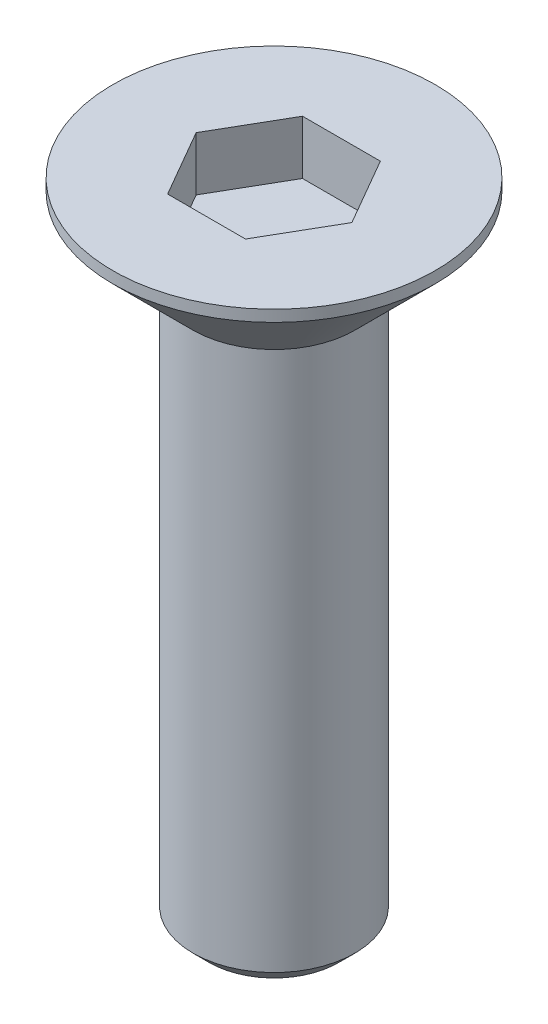
ISO-10303-21;
HEADER;
FILE_DESCRIPTION(('STEP AP214'),'2;1');
FILE_NAME('part.step','',(''),(''),'','','');
FILE_SCHEMA(('AUTOMOTIVE_DESIGN { 1 0 10303 214 1 1 1 1 }'));
ENDSEC;
DATA;
#1=APPLICATION_CONTEXT('core data for automotive mechanical design processes');
#2=APPLICATION_PROTOCOL_DEFINITION('international standard','automotive_design',2000,#1);
#3=PRODUCT_CONTEXT('',#1,'mechanical');
#4=PRODUCT('Part','Part','',(#3));
#5=PRODUCT_RELATED_PRODUCT_CATEGORY('part','',(#4));
#6=PRODUCT_DEFINITION_FORMATION('','',#4);
#7=PRODUCT_DEFINITION_CONTEXT('part definition',#1,'design');
#8=PRODUCT_DEFINITION('design','',#6,#7);
#9=PRODUCT_DEFINITION_SHAPE('','',#8);
#10=(LENGTH_UNIT() NAMED_UNIT(*) SI_UNIT(.MILLI.,.METRE.));
#11=(NAMED_UNIT(*) PLANE_ANGLE_UNIT() SI_UNIT($,.RADIAN.));
#12=(NAMED_UNIT(*) SI_UNIT($,.STERADIAN.) SOLID_ANGLE_UNIT());
#13=UNCERTAINTY_MEASURE_WITH_UNIT(LENGTH_MEASURE(1.E-05),#10,'distance_accuracy_value','');
#14=(GEOMETRIC_REPRESENTATION_CONTEXT(3) GLOBAL_UNCERTAINTY_ASSIGNED_CONTEXT((#13)) GLOBAL_UNIT_ASSIGNED_CONTEXT((#10,
#11,#12)) REPRESENTATION_CONTEXT('',''));
#15=CARTESIAN_POINT('',(0.,0.,0.));
#16=DIRECTION('',(0.,0.,1.));
#17=DIRECTION('',(1.,0.,0.));
#18=AXIS2_PLACEMENT_3D('',#15,#16,#17);
#19=CARTESIAN_POINT('',(0.,0.,0.));
#20=DIRECTION('',(0.,-1.,0.));
#21=DIRECTION('',(0.,0.,-1.));
#22=AXIS2_PLACEMENT_3D('',#19,#20,#21);
#23=PLANE('',#22);
#24=DIRECTION('',(-0.5,0.,0.866025403784439));
#25=VECTOR('',#24,1.);
#26=CARTESIAN_POINT('',(-0.721687836487032,0.,-1.25));
#27=LINE('',#26,#25);
#28=CARTESIAN_POINT('',(-0.721687836487032,0.,-1.25));
#29=VERTEX_POINT('',#28);
#30=CARTESIAN_POINT('',(-1.44337567297406,0.,0.));
#31=VERTEX_POINT('',#30);
#32=EDGE_CURVE('E123',#29,#31,#27,.T.);
#33=ORIENTED_EDGE('',*,*,#32,.F.);
#34=DIRECTION('',(-1.,0.,0.));
#35=VECTOR('',#34,1.);
#36=CARTESIAN_POINT('',(0.721687836487033,0.,-1.25));
#37=LINE('',#36,#35);
#38=CARTESIAN_POINT('',(0.721687836487033,0.,-1.25));
#39=VERTEX_POINT('',#38);
#40=EDGE_CURVE('E49',#39,#29,#37,.T.);
#41=ORIENTED_EDGE('',*,*,#40,.F.);
#42=DIRECTION('',(-0.5,0.,-0.866025403784439));
#43=VECTOR('',#42,1.);
#44=CARTESIAN_POINT('',(1.44337567297406,0.,0.));
#45=LINE('',#44,#43);
#46=CARTESIAN_POINT('',(1.44337567297406,0.,0.));
#47=VERTEX_POINT('',#46);
#48=EDGE_CURVE('E132',#47,#39,#45,.T.);
#49=ORIENTED_EDGE('',*,*,#48,.F.);
#50=DIRECTION('',(0.5,0.,-0.866025403784438));
#51=VECTOR('',#50,1.);
#52=CARTESIAN_POINT('',(0.721687836487032,0.,1.25));
#53=LINE('',#52,#51);
#54=CARTESIAN_POINT('',(0.721687836487032,0.,1.25));
#55=VERTEX_POINT('',#54);
#56=EDGE_CURVE('E130',#55,#47,#53,.T.);
#57=ORIENTED_EDGE('',*,*,#56,.F.);
#58=DIRECTION('',(1.,0.,0.));
#59=VECTOR('',#58,1.);
#60=CARTESIAN_POINT('',(-0.721687836487033,0.,1.25));
#61=LINE('',#60,#59);
#62=CARTESIAN_POINT('',(-0.721687836487033,0.,1.25));
#63=VERTEX_POINT('',#62);
#64=EDGE_CURVE('E97',#63,#55,#61,.T.);
#65=ORIENTED_EDGE('',*,*,#64,.F.);
#66=DIRECTION('',(0.5,0.,0.866025403784439));
#67=VECTOR('',#66,1.);
#68=CARTESIAN_POINT('',(-1.44337567297406,0.,0.));
#69=LINE('',#68,#67);
#70=EDGE_CURVE('E126',#31,#63,#69,.T.);
#71=ORIENTED_EDGE('',*,*,#70,.F.);
#72=EDGE_LOOP('',(#33,#41,#49,#57,#65,#71));
#73=FACE_BOUND('',#72,.T.);
#74=CARTESIAN_POINT('',(0.,0.,0.));
#75=DIRECTION('',(0.,-1.,0.));
#76=DIRECTION('',(0.,0.,-1.));
#77=AXIS2_PLACEMENT_3D('',#74,#75,#76);
#78=CIRCLE('',#77,2.98786796564402);
#79=CARTESIAN_POINT('',(0.,0.,-2.98786796564402));
#80=VERTEX_POINT('',#79);
#81=EDGE_CURVE('E144',#80,#80,#78,.F.);
#82=ORIENTED_EDGE('',*,*,#81,.T.);
#83=EDGE_LOOP('',(#82));
#84=FACE_BOUND('',#83,.T.);
#85=ADVANCED_FACE('F34',(#73,#84),#23,.F.);
#86=CARTESIAN_POINT('',(0.,-1.7,0.));
#87=DIRECTION('',(0.,1.,0.));
#88=DIRECTION('',(0.,0.,1.));
#89=AXIS2_PLACEMENT_3D('',#86,#87,#88);
#90=CONICAL_SURFACE('',#89,1.5,0.785398163397443);
#91=CARTESIAN_POINT('',(0.,-0.212132034355965,0.));
#92=DIRECTION('',(0.,-1.,0.));
#93=DIRECTION('',(0.,0.,-1.));
#94=AXIS2_PLACEMENT_3D('',#91,#92,#93);
#95=CIRCLE('',#94,2.98786796564402);
#96=CARTESIAN_POINT('',(0.,-0.212132034355965,-2.98786796564402));
#97=VERTEX_POINT('',#96);
#98=EDGE_CURVE('E147',#97,#97,#95,.T.);
#99=ORIENTED_EDGE('',*,*,#98,.T.);
#100=EDGE_LOOP('',(#99));
#101=FACE_BOUND('',#100,.T.);
#102=CARTESIAN_POINT('',(0.,-1.7,0.));
#103=DIRECTION('',(0.,1.,0.));
#104=DIRECTION('',(0.,0.,1.));
#105=AXIS2_PLACEMENT_3D('',#102,#103,#104);
#106=CIRCLE('',#105,1.5);
#107=CARTESIAN_POINT('',(0.,-1.7,1.5));
#108=VERTEX_POINT('',#107);
#109=EDGE_CURVE('E136',#108,#108,#106,.T.);
#110=ORIENTED_EDGE('',*,*,#109,.T.);
#111=EDGE_LOOP('',(#110));
#112=FACE_BOUND('',#111,.T.);
#113=ADVANCED_FACE('F169',(#101,#112),#90,.T.);
#114=CARTESIAN_POINT('',(0.,0.,0.));
#115=DIRECTION('',(0.,1.,0.));
#116=DIRECTION('',(0.,0.,1.));
#117=AXIS2_PLACEMENT_3D('',#114,#115,#116);
#118=CYLINDRICAL_SURFACE('',#117,1.5);
#119=CARTESIAN_POINT('',(0.,-11.7,0.));
#120=DIRECTION('',(0.,1.,0.));
#121=DIRECTION('',(0.,0.,1.));
#122=AXIS2_PLACEMENT_3D('',#119,#120,#121);
#123=CIRCLE('',#122,1.5);
#124=CARTESIAN_POINT('',(0.,-11.7,1.5));
#125=VERTEX_POINT('',#124);
#126=EDGE_CURVE('E42',#125,#125,#123,.T.);
#127=ORIENTED_EDGE('',*,*,#126,.T.);
#128=EDGE_LOOP('',(#127));
#129=FACE_BOUND('',#128,.T.);
#130=ORIENTED_EDGE('',*,*,#109,.F.);
#131=EDGE_LOOP('',(#130));
#132=FACE_BOUND('',#131,.T.);
#133=ADVANCED_FACE('F152',(#129,#132),#118,.T.);
#134=CARTESIAN_POINT('',(1.5,-12.,0.));
#135=DIRECTION('',(0.,1.,0.));
#136=DIRECTION('',(0.,0.,1.));
#137=AXIS2_PLACEMENT_3D('',#134,#135,#136);
#138=PLANE('',#137);
#139=CARTESIAN_POINT('',(0.,-12.,0.));
#140=DIRECTION('',(0.,1.,0.));
#141=DIRECTION('',(0.,0.,1.));
#142=AXIS2_PLACEMENT_3D('',#139,#140,#141);
#143=CIRCLE('',#142,1.2);
#144=CARTESIAN_POINT('',(0.,-12.,1.2));
#145=VERTEX_POINT('',#144);
#146=EDGE_CURVE('E11',#145,#145,#143,.F.);
#147=ORIENTED_EDGE('',*,*,#146,.T.);
#148=EDGE_LOOP('',(#147));
#149=FACE_BOUND('',#148,.T.);
#150=ADVANCED_FACE('F165',(#149),#138,.F.);
#151=CARTESIAN_POINT('',(0.,0.,0.));
#152=DIRECTION('',(0.,-1.,0.));
#153=DIRECTION('',(0.,0.,-1.));
#154=AXIS2_PLACEMENT_3D('',#151,#152,#153);
#155=CYLINDRICAL_SURFACE('',#154,2.98786796564402);
#156=ORIENTED_EDGE('',*,*,#98,.F.);
#157=EDGE_LOOP('',(#156));
#158=FACE_BOUND('',#157,.T.);
#159=ORIENTED_EDGE('',*,*,#81,.F.);
#160=EDGE_LOOP('',(#159));
#161=FACE_BOUND('',#160,.T.);
#162=ADVANCED_FACE('F157',(#158,#161),#155,.T.);
#163=CARTESIAN_POINT('',(0.,-11.7,0.));
#164=DIRECTION('',(0.,1.,0.));
#165=DIRECTION('',(0.,0.,1.));
#166=AXIS2_PLACEMENT_3D('',#163,#164,#165);
#167=CONICAL_SURFACE('',#166,1.5,0.78539816339745);
#168=ORIENTED_EDGE('',*,*,#146,.F.);
#169=EDGE_LOOP('',(#168));
#170=FACE_BOUND('',#169,.T.);
#171=ORIENTED_EDGE('',*,*,#126,.F.);
#172=EDGE_LOOP('',(#171));
#173=FACE_BOUND('',#172,.T.);
#174=ADVANCED_FACE('F36',(#170,#173),#167,.T.);
#175=CARTESIAN_POINT('',(0.721687836487033,-1.,-1.25));
#176=DIRECTION('',(0.,0.,-1.));
#177=DIRECTION('',(-1.,0.,0.));
#178=AXIS2_PLACEMENT_3D('',#175,#176,#177);
#179=PLANE('',#178);
#180=ORIENTED_EDGE('',*,*,#40,.T.);
#181=DIRECTION('',(0.,1.,0.));
#182=VECTOR('',#181,1.);
#183=CARTESIAN_POINT('',(-0.721687836487032,-1.,-1.25));
#184=LINE('',#183,#182);
#185=CARTESIAN_POINT('',(-0.721687836487032,-1.,-1.25));
#186=VERTEX_POINT('',#185);
#187=EDGE_CURVE('E79',#186,#29,#184,.T.);
#188=ORIENTED_EDGE('',*,*,#187,.F.);
#189=DIRECTION('',(-1.,0.,0.));
#190=VECTOR('',#189,1.);
#191=CARTESIAN_POINT('',(0.721687836487033,-1.,-1.25));
#192=LINE('',#191,#190);
#193=CARTESIAN_POINT('',(0.721687836487033,-1.,-1.25));
#194=VERTEX_POINT('',#193);
#195=EDGE_CURVE('E134',#194,#186,#192,.T.);
#196=ORIENTED_EDGE('',*,*,#195,.F.);
#197=DIRECTION('',(0.,1.,0.));
#198=VECTOR('',#197,1.);
#199=CARTESIAN_POINT('',(0.721687836487033,-1.,-1.25));
#200=LINE('',#199,#198);
#201=EDGE_CURVE('E57',#194,#39,#200,.T.);
#202=ORIENTED_EDGE('',*,*,#201,.T.);
#203=EDGE_LOOP('',(#180,#188,#196,#202));
#204=FACE_BOUND('',#203,.T.);
#205=ADVANCED_FACE('F156',(#204),#179,.F.);
#206=CARTESIAN_POINT('',(1.44337567297406,-1.,0.));
#207=DIRECTION('',(0.866025403784439,0.,-0.5));
#208=DIRECTION('',(-0.5,0.,-0.866025403784439));
#209=AXIS2_PLACEMENT_3D('',#206,#207,#208);
#210=PLANE('',#209);
#211=ORIENTED_EDGE('',*,*,#48,.T.);
#212=ORIENTED_EDGE('',*,*,#201,.F.);
#213=DIRECTION('',(-0.5,0.,-0.866025403784439));
#214=VECTOR('',#213,1.);
#215=CARTESIAN_POINT('',(1.44337567297406,-1.,0.));
#216=LINE('',#215,#214);
#217=CARTESIAN_POINT('',(1.44337567297406,-1.,0.));
#218=VERTEX_POINT('',#217);
#219=EDGE_CURVE('E109',#218,#194,#216,.T.);
#220=ORIENTED_EDGE('',*,*,#219,.F.);
#221=DIRECTION('',(0.,1.,0.));
#222=VECTOR('',#221,1.);
#223=CARTESIAN_POINT('',(1.44337567297406,-1.,0.));
#224=LINE('',#223,#222);
#225=EDGE_CURVE('E101',#218,#47,#224,.T.);
#226=ORIENTED_EDGE('',*,*,#225,.T.);
#227=EDGE_LOOP('',(#211,#212,#220,#226));
#228=FACE_BOUND('',#227,.T.);
#229=ADVANCED_FACE('F163',(#228),#210,.F.);
#230=CARTESIAN_POINT('',(0.721687836487032,-1.,1.25));
#231=DIRECTION('',(0.866025403784439,0.,0.5));
#232=DIRECTION('',(0.5,0.,-0.866025403784438));
#233=AXIS2_PLACEMENT_3D('',#230,#231,#232);
#234=PLANE('',#233);
#235=ORIENTED_EDGE('',*,*,#56,.T.);
#236=ORIENTED_EDGE('',*,*,#225,.F.);
#237=DIRECTION('',(0.5,0.,-0.866025403784438));
#238=VECTOR('',#237,1.);
#239=CARTESIAN_POINT('',(0.721687836487032,-1.,1.25));
#240=LINE('',#239,#238);
#241=CARTESIAN_POINT('',(0.721687836487032,-1.,1.25));
#242=VERTEX_POINT('',#241);
#243=EDGE_CURVE('E105',#242,#218,#240,.T.);
#244=ORIENTED_EDGE('',*,*,#243,.F.);
#245=DIRECTION('',(0.,1.,0.));
#246=VECTOR('',#245,1.);
#247=CARTESIAN_POINT('',(0.721687836487032,-1.,1.25));
#248=LINE('',#247,#246);
#249=EDGE_CURVE('E90',#242,#55,#248,.T.);
#250=ORIENTED_EDGE('',*,*,#249,.T.);
#251=EDGE_LOOP('',(#235,#236,#244,#250));
#252=FACE_BOUND('',#251,.T.);
#253=ADVANCED_FACE('F106',(#252),#234,.F.);
#254=CARTESIAN_POINT('',(-0.721687836487033,-1.,1.25));
#255=DIRECTION('',(0.,0.,1.));
#256=DIRECTION('',(1.,0.,0.));
#257=AXIS2_PLACEMENT_3D('',#254,#255,#256);
#258=PLANE('',#257);
#259=ORIENTED_EDGE('',*,*,#64,.T.);
#260=ORIENTED_EDGE('',*,*,#249,.F.);
#261=DIRECTION('',(1.,0.,0.));
#262=VECTOR('',#261,1.);
#263=CARTESIAN_POINT('',(-0.721687836487033,-1.,1.25));
#264=LINE('',#263,#262);
#265=CARTESIAN_POINT('',(-0.721687836487033,-1.,1.25));
#266=VERTEX_POINT('',#265);
#267=EDGE_CURVE('E94',#266,#242,#264,.T.);
#268=ORIENTED_EDGE('',*,*,#267,.F.);
#269=DIRECTION('',(0.,1.,0.));
#270=VECTOR('',#269,1.);
#271=CARTESIAN_POINT('',(-0.721687836487033,-1.,1.25));
#272=LINE('',#271,#270);
#273=EDGE_CURVE('E102',#266,#63,#272,.T.);
#274=ORIENTED_EDGE('',*,*,#273,.T.);
#275=EDGE_LOOP('',(#259,#260,#268,#274));
#276=FACE_BOUND('',#275,.T.);
#277=ADVANCED_FACE('F92',(#276),#258,.F.);
#278=CARTESIAN_POINT('',(-1.44337567297406,-1.,0.));
#279=DIRECTION('',(-0.866025403784439,0.,0.5));
#280=DIRECTION('',(0.5,0.,0.866025403784439));
#281=AXIS2_PLACEMENT_3D('',#278,#279,#280);
#282=PLANE('',#281);
#283=ORIENTED_EDGE('',*,*,#70,.T.);
#284=ORIENTED_EDGE('',*,*,#273,.F.);
#285=DIRECTION('',(0.5,0.,0.866025403784439));
#286=VECTOR('',#285,1.);
#287=CARTESIAN_POINT('',(-1.44337567297406,-1.,0.));
#288=LINE('',#287,#286);
#289=CARTESIAN_POINT('',(-1.44337567297406,-1.,0.));
#290=VERTEX_POINT('',#289);
#291=EDGE_CURVE('E115',#290,#266,#288,.T.);
#292=ORIENTED_EDGE('',*,*,#291,.F.);
#293=DIRECTION('',(0.,1.,0.));
#294=VECTOR('',#293,1.);
#295=CARTESIAN_POINT('',(-1.44337567297406,-1.,0.));
#296=LINE('',#295,#294);
#297=EDGE_CURVE('E139',#290,#31,#296,.T.);
#298=ORIENTED_EDGE('',*,*,#297,.T.);
#299=EDGE_LOOP('',(#283,#284,#292,#298));
#300=FACE_BOUND('',#299,.T.);
#301=ADVANCED_FACE('F188',(#300),#282,.F.);
#302=CARTESIAN_POINT('',(-0.721687836487032,-1.,-1.25));
#303=DIRECTION('',(-0.866025403784439,0.,-0.5));
#304=DIRECTION('',(-0.5,0.,0.866025403784439));
#305=AXIS2_PLACEMENT_3D('',#302,#303,#304);
#306=PLANE('',#305);
#307=ORIENTED_EDGE('',*,*,#32,.T.);
#308=ORIENTED_EDGE('',*,*,#297,.F.);
#309=DIRECTION('',(-0.5,0.,0.866025403784439));
#310=VECTOR('',#309,1.);
#311=CARTESIAN_POINT('',(-0.721687836487032,-1.,-1.25));
#312=LINE('',#311,#310);
#313=EDGE_CURVE('E117',#186,#290,#312,.T.);
#314=ORIENTED_EDGE('',*,*,#313,.F.);
#315=ORIENTED_EDGE('',*,*,#187,.T.);
#316=EDGE_LOOP('',(#307,#308,#314,#315));
#317=FACE_BOUND('',#316,.T.);
#318=ADVANCED_FACE('F185',(#317),#306,.F.);
#319=CARTESIAN_POINT('',(-0.721687836487032,-1.,-1.25));
#320=DIRECTION('',(0.,1.,0.));
#321=DIRECTION('',(0.,0.,1.));
#322=AXIS2_PLACEMENT_3D('',#319,#320,#321);
#323=PLANE('',#322);
#324=ORIENTED_EDGE('',*,*,#195,.T.);
#325=ORIENTED_EDGE('',*,*,#313,.T.);
#326=ORIENTED_EDGE('',*,*,#291,.T.);
#327=ORIENTED_EDGE('',*,*,#267,.T.);
#328=ORIENTED_EDGE('',*,*,#243,.T.);
#329=ORIENTED_EDGE('',*,*,#219,.T.);
#330=EDGE_LOOP('',(#324,#325,#326,#327,#328,#329));
#331=FACE_BOUND('',#330,.T.);
#332=ADVANCED_FACE('F112',(#331),#323,.T.);
#333=CLOSED_SHELL('',(#85,#113,#133,#150,#162,#174,#205,#229,#253,#277,#301,#318,#332));
#334=MANIFOLD_SOLID_BREP('B2',#333);
#335=ADVANCED_BREP_SHAPE_REPRESENTATION('',(#18,#334),#14);
#336=SHAPE_DEFINITION_REPRESENTATION(#9,#335);
ENDSEC;
END-ISO-10303-21;
